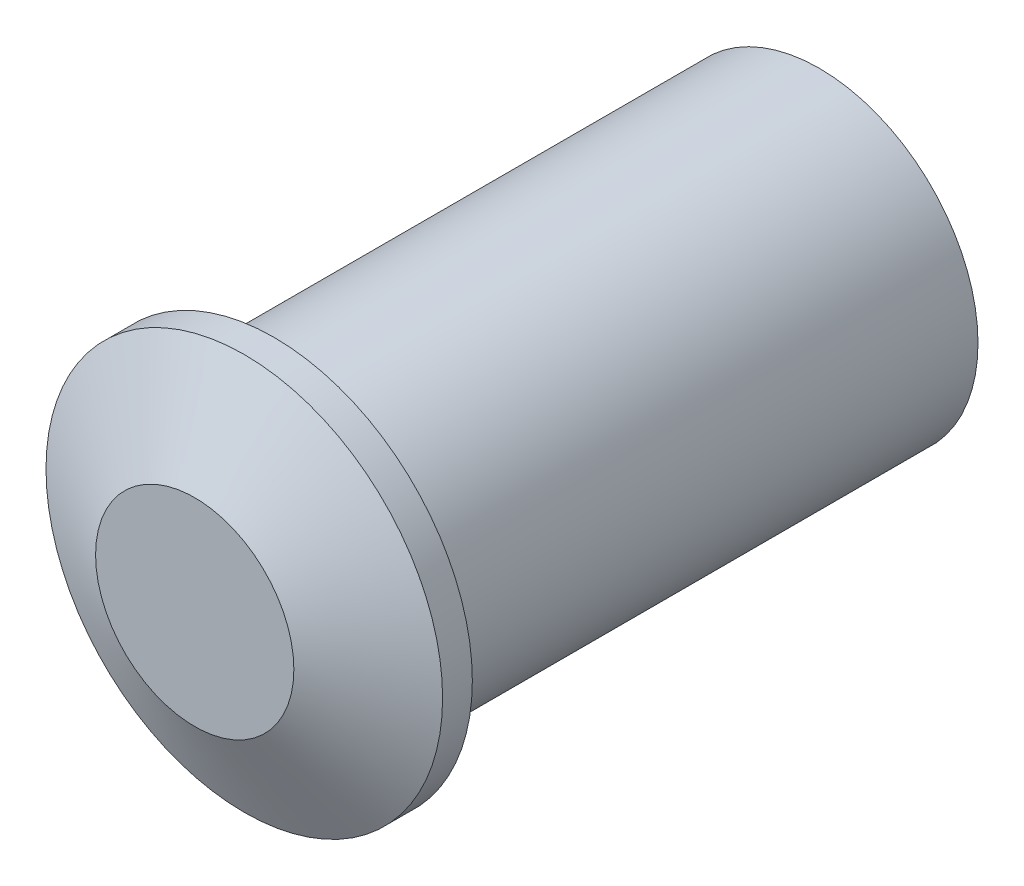
ISO-10303-21;
HEADER;
FILE_DESCRIPTION(('STEP AP214'),'2;1');
FILE_NAME('part.step','',(''),(''),'','','');
FILE_SCHEMA(('AUTOMOTIVE_DESIGN { 1 0 10303 214 1 1 1 1 }'));
ENDSEC;
DATA;
#1=APPLICATION_CONTEXT('core data for automotive mechanical design processes');
#2=APPLICATION_PROTOCOL_DEFINITION('international standard','automotive_design',2000,#1);
#3=PRODUCT_CONTEXT('',#1,'mechanical');
#4=PRODUCT('Part','Part','',(#3));
#5=PRODUCT_RELATED_PRODUCT_CATEGORY('part','',(#4));
#6=PRODUCT_DEFINITION_FORMATION('','',#4);
#7=PRODUCT_DEFINITION_CONTEXT('part definition',#1,'design');
#8=PRODUCT_DEFINITION('design','',#6,#7);
#9=PRODUCT_DEFINITION_SHAPE('','',#8);
#10=(LENGTH_UNIT() NAMED_UNIT(*) SI_UNIT(.MILLI.,.METRE.));
#11=(NAMED_UNIT(*) PLANE_ANGLE_UNIT() SI_UNIT($,.RADIAN.));
#12=(NAMED_UNIT(*) SI_UNIT($,.STERADIAN.) SOLID_ANGLE_UNIT());
#13=UNCERTAINTY_MEASURE_WITH_UNIT(LENGTH_MEASURE(1.E-05),#10,'distance_accuracy_value','');
#14=(GEOMETRIC_REPRESENTATION_CONTEXT(3) GLOBAL_UNCERTAINTY_ASSIGNED_CONTEXT((#13)) GLOBAL_UNIT_ASSIGNED_CONTEXT((#10,
#11,#12)) REPRESENTATION_CONTEXT('',''));
#15=CARTESIAN_POINT('',(0.,0.,0.));
#16=DIRECTION('',(0.,0.,1.));
#17=DIRECTION('',(1.,0.,0.));
#18=AXIS2_PLACEMENT_3D('',#15,#16,#17);
#19=CARTESIAN_POINT('',(0.,0.,-2.5));
#20=DIRECTION('',(0.,0.,-1.));
#21=DIRECTION('',(-1.,0.,0.));
#22=AXIS2_PLACEMENT_3D('',#19,#20,#21);
#23=CONICAL_SURFACE('',#22,10.,1.10714871779409);
#24=CARTESIAN_POINT('',(0.,0.,0.));
#25=DIRECTION('',(0.,0.,-1.));
#26=DIRECTION('',(-1.,0.,0.));
#27=AXIS2_PLACEMENT_3D('',#24,#25,#26);
#28=CIRCLE('',#27,5.);
#29=CARTESIAN_POINT('',(-5.,0.,0.));
#30=VERTEX_POINT('',#29);
#31=CARTESIAN_POINT('',(5.,0.,0.));
#32=VERTEX_POINT('',#31);
#33=EDGE_CURVE('E199',#30,#32,#28,.T.);
#34=ORIENTED_EDGE('',*,*,#33,.T.);
#35=DIRECTION('',(0.894427190999916,0.,-0.447213595499958));
#36=VECTOR('',#35,1.);
#37=CARTESIAN_POINT('',(10.,0.,-2.5));
#38=LINE('',#37,#36);
#39=CARTESIAN_POINT('',(10.,0.,-2.5));
#40=VERTEX_POINT('',#39);
#41=EDGE_CURVE('E11',#32,#40,#38,.T.);
#42=ORIENTED_EDGE('',*,*,#41,.T.);
#43=CARTESIAN_POINT('',(0.,0.,-2.5));
#44=DIRECTION('',(0.,0.,1.));
#45=DIRECTION('',(-1.,0.,0.));
#46=AXIS2_PLACEMENT_3D('',#43,#44,#45);
#47=CIRCLE('',#46,10.);
#48=CARTESIAN_POINT('',(-10.,0.,-2.5));
#49=VERTEX_POINT('',#48);
#50=EDGE_CURVE('E170',#40,#49,#47,.T.);
#51=ORIENTED_EDGE('',*,*,#50,.T.);
#52=CARTESIAN_POINT('',(0.,0.,-2.5));
#53=DIRECTION('',(0.,0.,1.));
#54=DIRECTION('',(-1.,0.,0.));
#55=AXIS2_PLACEMENT_3D('',#52,#53,#54);
#56=CIRCLE('',#55,10.);
#57=EDGE_CURVE('E185',#49,#40,#56,.T.);
#58=ORIENTED_EDGE('',*,*,#57,.T.);
#59=ORIENTED_EDGE('',*,*,#41,.F.);
#60=CARTESIAN_POINT('',(0.,0.,0.));
#61=DIRECTION('',(0.,0.,-1.));
#62=DIRECTION('',(-1.,0.,0.));
#63=AXIS2_PLACEMENT_3D('',#60,#61,#62);
#64=CIRCLE('',#63,5.);
#65=EDGE_CURVE('E27',#32,#30,#64,.T.);
#66=ORIENTED_EDGE('',*,*,#65,.T.);
#67=EDGE_LOOP('',(#34,#42,#51,#58,#59,#66));
#68=FACE_BOUND('',#67,.T.);
#69=ADVANCED_FACE('F16',(#68),#23,.T.);
#70=CARTESIAN_POINT('',(0.,0.,0.));
#71=DIRECTION('',(0.,0.,-1.));
#72=DIRECTION('',(0.,-1.,0.));
#73=AXIS2_PLACEMENT_3D('',#70,#71,#72);
#74=PLANE('',#73);
#75=ORIENTED_EDGE('',*,*,#33,.F.);
#76=ORIENTED_EDGE('',*,*,#65,.F.);
#77=EDGE_LOOP('',(#75,#76));
#78=FACE_BOUND('',#77,.T.);
#79=ADVANCED_FACE('F243',(#78),#74,.F.);
#80=CARTESIAN_POINT('',(0.,0.,-4.));
#81=DIRECTION('',(0.,0.,1.));
#82=DIRECTION('',(1.,0.,0.));
#83=AXIS2_PLACEMENT_3D('',#80,#81,#82);
#84=PLANE('',#83);
#85=CARTESIAN_POINT('',(0.,0.,-4.));
#86=DIRECTION('',(0.,0.,1.));
#87=DIRECTION('',(1.,0.,0.));
#88=AXIS2_PLACEMENT_3D('',#85,#86,#87);
#89=CIRCLE('',#88,8.);
#90=CARTESIAN_POINT('',(-8.,0.,-4.));
#91=VERTEX_POINT('',#90);
#92=EDGE_CURVE('E178',#91,#91,#89,.T.);
#93=ORIENTED_EDGE('',*,*,#92,.T.);
#94=EDGE_LOOP('',(#93));
#95=FACE_BOUND('',#94,.T.);
#96=CARTESIAN_POINT('',(0.,0.,-4.));
#97=DIRECTION('',(0.,0.,-1.));
#98=DIRECTION('',(1.,0.,0.));
#99=AXIS2_PLACEMENT_3D('',#96,#97,#98);
#100=CIRCLE('',#99,10.);
#101=CARTESIAN_POINT('',(10.,0.,-4.));
#102=VERTEX_POINT('',#101);
#103=CARTESIAN_POINT('',(-10.,0.,-4.));
#104=VERTEX_POINT('',#103);
#105=EDGE_CURVE('E161',#102,#104,#100,.T.);
#106=ORIENTED_EDGE('',*,*,#105,.T.);
#107=CARTESIAN_POINT('',(0.,0.,-4.));
#108=DIRECTION('',(0.,0.,-1.));
#109=DIRECTION('',(1.,0.,0.));
#110=AXIS2_PLACEMENT_3D('',#107,#108,#109);
#111=CIRCLE('',#110,10.);
#112=EDGE_CURVE('E158',#104,#102,#111,.T.);
#113=ORIENTED_EDGE('',*,*,#112,.T.);
#114=EDGE_LOOP('',(#106,#113));
#115=FACE_BOUND('',#114,.T.);
#116=ADVANCED_FACE('F247',(#95,#115),#84,.F.);
#117=CARTESIAN_POINT('',(0.,0.,-2.5));
#118=DIRECTION('',(0.,0.,-1.));
#119=DIRECTION('',(1.,0.,0.));
#120=AXIS2_PLACEMENT_3D('',#117,#118,#119);
#121=CYLINDRICAL_SURFACE('',#120,10.);
#122=ORIENTED_EDGE('',*,*,#105,.F.);
#123=ORIENTED_EDGE('',*,*,#112,.F.);
#124=DIRECTION('',(0.,0.,1.));
#125=VECTOR('',#124,1.);
#126=CARTESIAN_POINT('',(-10.,0.,-2.5));
#127=LINE('',#126,#125);
#128=EDGE_CURVE('E160',#104,#49,#127,.T.);
#129=ORIENTED_EDGE('',*,*,#128,.T.);
#130=ORIENTED_EDGE('',*,*,#50,.F.);
#131=ORIENTED_EDGE('',*,*,#57,.F.);
#132=ORIENTED_EDGE('',*,*,#128,.F.);
#133=EDGE_LOOP('',(#122,#123,#129,#130,#131,#132));
#134=FACE_BOUND('',#133,.T.);
#135=ADVANCED_FACE('F256',(#134),#121,.T.);
#136=CARTESIAN_POINT('',(0.,0.,-31.5));
#137=DIRECTION('',(0.,0.,1.));
#138=DIRECTION('',(1.,0.,0.));
#139=AXIS2_PLACEMENT_3D('',#136,#137,#138);
#140=PLANE('',#139);
#141=CARTESIAN_POINT('',(0.,0.,-31.5));
#142=DIRECTION('',(0.,0.,1.));
#143=DIRECTION('',(-1.,0.,0.));
#144=AXIS2_PLACEMENT_3D('',#141,#142,#143);
#145=CIRCLE('',#144,7.5);
#146=CARTESIAN_POINT('',(-7.5,0.,-31.5));
#147=VERTEX_POINT('',#146);
#148=CARTESIAN_POINT('',(7.5,0.,-31.5));
#149=VERTEX_POINT('',#148);
#150=EDGE_CURVE('E188',#147,#149,#145,.T.);
#151=ORIENTED_EDGE('',*,*,#150,.T.);
#152=CARTESIAN_POINT('',(0.,0.,-31.5));
#153=DIRECTION('',(0.,0.,1.));
#154=DIRECTION('',(-1.,0.,0.));
#155=AXIS2_PLACEMENT_3D('',#152,#153,#154);
#156=CIRCLE('',#155,7.5);
#157=EDGE_CURVE('E85',#149,#147,#156,.T.);
#158=ORIENTED_EDGE('',*,*,#157,.T.);
#159=EDGE_LOOP('',(#151,#158));
#160=FACE_BOUND('',#159,.T.);
#161=CARTESIAN_POINT('',(0.,0.,-31.5));
#162=DIRECTION('',(0.,0.,-1.));
#163=DIRECTION('',(1.,0.,0.));
#164=AXIS2_PLACEMENT_3D('',#161,#162,#163);
#165=CIRCLE('',#164,8.);
#166=CARTESIAN_POINT('',(8.,0.,-31.5));
#167=VERTEX_POINT('',#166);
#168=CARTESIAN_POINT('',(-8.,0.,-31.5));
#169=VERTEX_POINT('',#168);
#170=EDGE_CURVE('E171',#167,#169,#165,.T.);
#171=ORIENTED_EDGE('',*,*,#170,.T.);
#172=CARTESIAN_POINT('',(0.,0.,-31.5));
#173=DIRECTION('',(0.,0.,-1.));
#174=DIRECTION('',(1.,0.,0.));
#175=AXIS2_PLACEMENT_3D('',#172,#173,#174);
#176=CIRCLE('',#175,8.);
#177=EDGE_CURVE('E175',#169,#167,#176,.T.);
#178=ORIENTED_EDGE('',*,*,#177,.T.);
#179=EDGE_LOOP('',(#171,#178));
#180=FACE_BOUND('',#179,.T.);
#181=ADVANCED_FACE('F18',(#160,#180),#140,.F.);
#182=CARTESIAN_POINT('',(0.,0.,-2.5));
#183=DIRECTION('',(0.,0.,-1.));
#184=DIRECTION('',(1.,0.,0.));
#185=AXIS2_PLACEMENT_3D('',#182,#183,#184);
#186=CYLINDRICAL_SURFACE('',#185,8.);
#187=ORIENTED_EDGE('',*,*,#170,.F.);
#188=ORIENTED_EDGE('',*,*,#177,.F.);
#189=DIRECTION('',(0.,0.,1.));
#190=VECTOR('',#189,1.);
#191=CARTESIAN_POINT('',(-8.,0.,-2.5));
#192=LINE('',#191,#190);
#193=EDGE_CURVE('E180',#169,#91,#192,.T.);
#194=ORIENTED_EDGE('',*,*,#193,.T.);
#195=ORIENTED_EDGE('',*,*,#92,.F.);
#196=ORIENTED_EDGE('',*,*,#193,.F.);
#197=EDGE_LOOP('',(#187,#188,#194,#195,#196));
#198=FACE_BOUND('',#197,.T.);
#199=ADVANCED_FACE('F254',(#198),#186,.T.);
#200=CARTESIAN_POINT('',(0.,0.,-16.5));
#201=DIRECTION('',(0.,0.,-1.));
#202=DIRECTION('',(0.,-1.,0.));
#203=AXIS2_PLACEMENT_3D('',#200,#201,#202);
#204=PLANE('',#203);
#205=CARTESIAN_POINT('',(0.,0.,-16.5));
#206=DIRECTION('',(0.,0.,1.));
#207=DIRECTION('',(-1.,0.,0.));
#208=AXIS2_PLACEMENT_3D('',#205,#206,#207);
#209=CIRCLE('',#208,1.);
#210=CARTESIAN_POINT('',(-1.,0.,-16.5));
#211=VERTEX_POINT('',#210);
#212=CARTESIAN_POINT('',(1.,0.,-16.5));
#213=VERTEX_POINT('',#212);
#214=EDGE_CURVE('E189',#211,#213,#209,.T.);
#215=ORIENTED_EDGE('',*,*,#214,.T.);
#216=CARTESIAN_POINT('',(0.,0.,-16.5));
#217=DIRECTION('',(0.,0.,1.));
#218=DIRECTION('',(-1.,0.,0.));
#219=AXIS2_PLACEMENT_3D('',#216,#217,#218);
#220=CIRCLE('',#219,1.);
#221=EDGE_CURVE('E95',#213,#211,#220,.T.);
#222=ORIENTED_EDGE('',*,*,#221,.T.);
#223=EDGE_LOOP('',(#215,#222));
#224=FACE_BOUND('',#223,.T.);
#225=CARTESIAN_POINT('',(0.,0.,-16.5));
#226=DIRECTION('',(0.,0.,1.));
#227=DIRECTION('',(-1.,0.,0.));
#228=AXIS2_PLACEMENT_3D('',#225,#226,#227);
#229=CIRCLE('',#228,7.5);
#230=CARTESIAN_POINT('',(-7.5,0.,-16.5));
#231=VERTEX_POINT('',#230);
#232=CARTESIAN_POINT('',(7.5,0.,-16.5));
#233=VERTEX_POINT('',#232);
#234=EDGE_CURVE('E166',#231,#233,#229,.T.);
#235=ORIENTED_EDGE('',*,*,#234,.F.);
#236=CARTESIAN_POINT('',(0.,0.,-16.5));
#237=DIRECTION('',(0.,0.,1.));
#238=DIRECTION('',(-1.,0.,0.));
#239=AXIS2_PLACEMENT_3D('',#236,#237,#238);
#240=CIRCLE('',#239,7.5);
#241=EDGE_CURVE('E162',#233,#231,#240,.T.);
#242=ORIENTED_EDGE('',*,*,#241,.F.);
#243=EDGE_LOOP('',(#235,#242));
#244=FACE_BOUND('',#243,.T.);
#245=ADVANCED_FACE('F251',(#224,#244),#204,.T.);
#246=CARTESIAN_POINT('',(0.,0.,-31.5));
#247=DIRECTION('',(0.,0.,1.));
#248=DIRECTION('',(-1.,0.,0.));
#249=AXIS2_PLACEMENT_3D('',#246,#247,#248);
#250=CYLINDRICAL_SURFACE('',#249,7.5);
#251=ORIENTED_EDGE('',*,*,#150,.F.);
#252=ORIENTED_EDGE('',*,*,#157,.F.);
#253=DIRECTION('',(0.,0.,1.));
#254=VECTOR('',#253,1.);
#255=CARTESIAN_POINT('',(7.5,0.,-31.5));
#256=LINE('',#255,#254);
#257=EDGE_CURVE('E75',#149,#233,#256,.T.);
#258=ORIENTED_EDGE('',*,*,#257,.T.);
#259=ORIENTED_EDGE('',*,*,#241,.T.);
#260=ORIENTED_EDGE('',*,*,#234,.T.);
#261=ORIENTED_EDGE('',*,*,#257,.F.);
#262=EDGE_LOOP('',(#251,#252,#258,#259,#260,#261));
#263=FACE_BOUND('',#262,.T.);
#264=ADVANCED_FACE('F253',(#263),#250,.F.);
#265=CARTESIAN_POINT('',(0.,0.,-31.5));
#266=DIRECTION('',(0.,0.,-1.));
#267=DIRECTION('',(0.,-1.,0.));
#268=AXIS2_PLACEMENT_3D('',#265,#266,#267);
#269=PLANE('',#268);
#270=CARTESIAN_POINT('',(0.,0.,-31.5));
#271=DIRECTION('',(0.,0.,1.));
#272=DIRECTION('',(-1.,0.,0.));
#273=AXIS2_PLACEMENT_3D('',#270,#271,#272);
#274=CIRCLE('',#273,0.5);
#275=CARTESIAN_POINT('',(-0.5,0.,-31.5));
#276=VERTEX_POINT('',#275);
#277=CARTESIAN_POINT('',(0.5,0.,-31.5));
#278=VERTEX_POINT('',#277);
#279=EDGE_CURVE('E138',#276,#278,#274,.T.);
#280=ORIENTED_EDGE('',*,*,#279,.T.);
#281=CARTESIAN_POINT('',(0.,0.,-31.5));
#282=DIRECTION('',(0.,0.,1.));
#283=DIRECTION('',(-1.,0.,0.));
#284=AXIS2_PLACEMENT_3D('',#281,#282,#283);
#285=CIRCLE('',#284,0.5);
#286=EDGE_CURVE('E131',#278,#276,#285,.T.);
#287=ORIENTED_EDGE('',*,*,#286,.T.);
#288=EDGE_LOOP('',(#280,#287));
#289=FACE_BOUND('',#288,.T.);
#290=CARTESIAN_POINT('',(0.,0.,-31.5));
#291=DIRECTION('',(0.,0.,-1.));
#292=DIRECTION('',(-1.,0.,0.));
#293=AXIS2_PLACEMENT_3D('',#290,#291,#292);
#294=CIRCLE('',#293,1.);
#295=CARTESIAN_POINT('',(-1.,0.,-31.5));
#296=VERTEX_POINT('',#295);
#297=CARTESIAN_POINT('',(1.,0.,-31.5));
#298=VERTEX_POINT('',#297);
#299=EDGE_CURVE('E141',#296,#298,#294,.T.);
#300=ORIENTED_EDGE('',*,*,#299,.T.);
#301=CARTESIAN_POINT('',(0.,0.,-31.5));
#302=DIRECTION('',(0.,0.,-1.));
#303=DIRECTION('',(-1.,0.,0.));
#304=AXIS2_PLACEMENT_3D('',#301,#302,#303);
#305=CIRCLE('',#304,1.);
#306=EDGE_CURVE('E157',#298,#296,#305,.T.);
#307=ORIENTED_EDGE('',*,*,#306,.T.);
#308=EDGE_LOOP('',(#300,#307));
#309=FACE_BOUND('',#308,.T.);
#310=ADVANCED_FACE('F143',(#289,#309),#269,.T.);
#311=CARTESIAN_POINT('',(0.,0.,-16.5));
#312=DIRECTION('',(0.,0.,-1.));
#313=DIRECTION('',(-1.,0.,0.));
#314=AXIS2_PLACEMENT_3D('',#311,#312,#313);
#315=CYLINDRICAL_SURFACE('',#314,1.);
#316=ORIENTED_EDGE('',*,*,#299,.F.);
#317=ORIENTED_EDGE('',*,*,#306,.F.);
#318=DIRECTION('',(0.,0.,1.));
#319=VECTOR('',#318,1.);
#320=CARTESIAN_POINT('',(1.,0.,-16.5));
#321=LINE('',#320,#319);
#322=EDGE_CURVE('E200',#298,#213,#321,.T.);
#323=ORIENTED_EDGE('',*,*,#322,.T.);
#324=ORIENTED_EDGE('',*,*,#214,.F.);
#325=ORIENTED_EDGE('',*,*,#221,.F.);
#326=ORIENTED_EDGE('',*,*,#322,.F.);
#327=EDGE_LOOP('',(#316,#317,#323,#324,#325,#326));
#328=FACE_BOUND('',#327,.T.);
#329=ADVANCED_FACE('F217',(#328),#315,.T.);
#330=CARTESIAN_POINT('',(0.,0.,-34.5));
#331=DIRECTION('',(0.,0.,-1.));
#332=DIRECTION('',(0.,-1.,0.));
#333=AXIS2_PLACEMENT_3D('',#330,#331,#332);
#334=PLANE('',#333);
#335=CARTESIAN_POINT('',(0.,0.,-34.5));
#336=DIRECTION('',(0.,0.,-1.));
#337=DIRECTION('',(-1.,0.,0.));
#338=AXIS2_PLACEMENT_3D('',#335,#336,#337);
#339=CIRCLE('',#338,0.5);
#340=CARTESIAN_POINT('',(-0.5,0.,-34.5));
#341=VERTEX_POINT('',#340);
#342=CARTESIAN_POINT('',(0.5,0.,-34.5));
#343=VERTEX_POINT('',#342);
#344=EDGE_CURVE('E154',#341,#343,#339,.T.);
#345=ORIENTED_EDGE('',*,*,#344,.T.);
#346=CARTESIAN_POINT('',(0.,0.,-34.5));
#347=DIRECTION('',(0.,0.,-1.));
#348=DIRECTION('',(-1.,0.,0.));
#349=AXIS2_PLACEMENT_3D('',#346,#347,#348);
#350=CIRCLE('',#349,0.5);
#351=EDGE_CURVE('E20',#343,#341,#350,.T.);
#352=ORIENTED_EDGE('',*,*,#351,.T.);
#353=EDGE_LOOP('',(#345,#352));
#354=FACE_BOUND('',#353,.T.);
#355=ADVANCED_FACE('F231',(#354),#334,.T.);
#356=CARTESIAN_POINT('',(0.,0.,-31.5));
#357=DIRECTION('',(0.,0.,-1.));
#358=DIRECTION('',(-1.,0.,0.));
#359=AXIS2_PLACEMENT_3D('',#356,#357,#358);
#360=CYLINDRICAL_SURFACE('',#359,0.5);
#361=ORIENTED_EDGE('',*,*,#344,.F.);
#362=ORIENTED_EDGE('',*,*,#351,.F.);
#363=DIRECTION('',(0.,0.,1.));
#364=VECTOR('',#363,1.);
#365=CARTESIAN_POINT('',(0.5,0.,-31.5));
#366=LINE('',#365,#364);
#367=EDGE_CURVE('E136',#343,#278,#366,.T.);
#368=ORIENTED_EDGE('',*,*,#367,.T.);
#369=ORIENTED_EDGE('',*,*,#279,.F.);
#370=ORIENTED_EDGE('',*,*,#286,.F.);
#371=ORIENTED_EDGE('',*,*,#367,.F.);
#372=EDGE_LOOP('',(#361,#362,#368,#369,#370,#371));
#373=FACE_BOUND('',#372,.T.);
#374=ADVANCED_FACE('F134',(#373),#360,.T.);
#375=CLOSED_SHELL('',(#69,#79,#116,#135,#181,#199,#245,#264,#310,#329,#355,#374));
#376=MANIFOLD_SOLID_BREP('B1',#375);
#377=ADVANCED_BREP_SHAPE_REPRESENTATION('',(#18,#376),#14);
#378=SHAPE_DEFINITION_REPRESENTATION(#9,#377);
ENDSEC;
END-ISO-10303-21;
